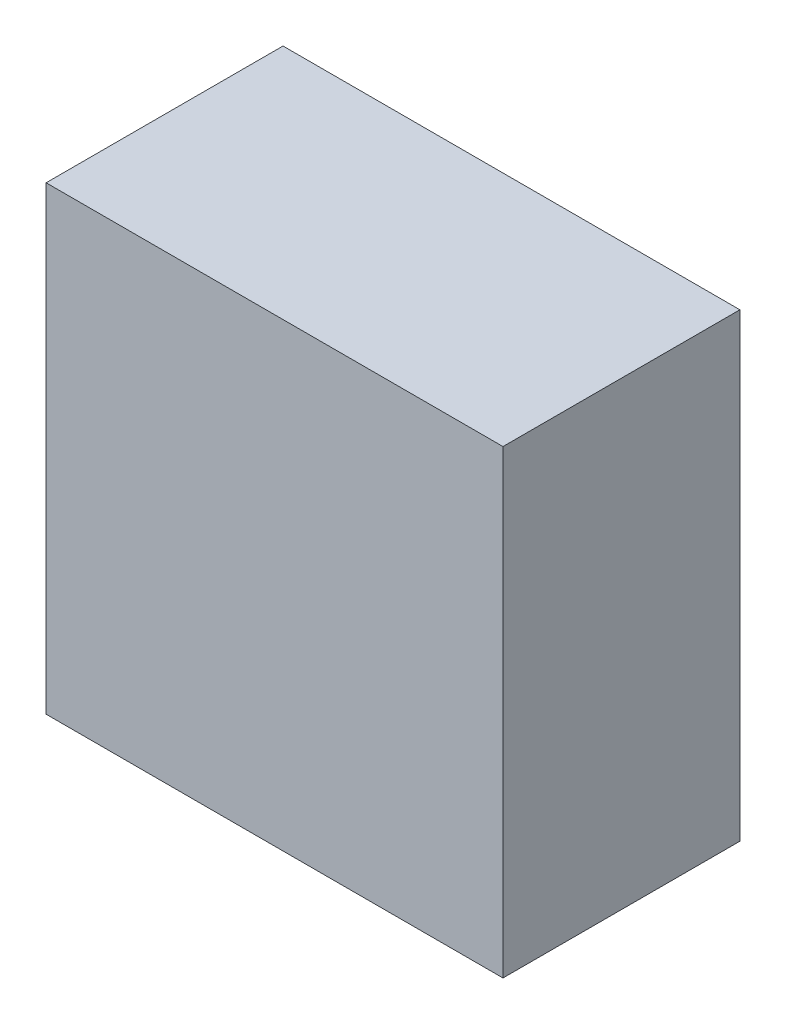
ISO-10303-21;
HEADER;
FILE_DESCRIPTION(('STEP AP214'),'2;1');
FILE_NAME('part.step','',(''),(''),'','','');
FILE_SCHEMA(('AUTOMOTIVE_DESIGN { 1 0 10303 214 1 1 1 1 }'));
ENDSEC;
DATA;
#1=APPLICATION_CONTEXT('core data for automotive mechanical design processes');
#2=APPLICATION_PROTOCOL_DEFINITION('international standard','automotive_design',2000,#1);
#3=PRODUCT_CONTEXT('',#1,'mechanical');
#4=PRODUCT('Part','Part','',(#3));
#5=PRODUCT_RELATED_PRODUCT_CATEGORY('part','',(#4));
#6=PRODUCT_DEFINITION_FORMATION('','',#4);
#7=PRODUCT_DEFINITION_CONTEXT('part definition',#1,'design');
#8=PRODUCT_DEFINITION('design','',#6,#7);
#9=PRODUCT_DEFINITION_SHAPE('','',#8);
#10=(LENGTH_UNIT() NAMED_UNIT(*) SI_UNIT(.MILLI.,.METRE.));
#11=(NAMED_UNIT(*) PLANE_ANGLE_UNIT() SI_UNIT($,.RADIAN.));
#12=(NAMED_UNIT(*) SI_UNIT($,.STERADIAN.) SOLID_ANGLE_UNIT());
#13=UNCERTAINTY_MEASURE_WITH_UNIT(LENGTH_MEASURE(1.E-05),#10,'distance_accuracy_value','');
#14=(GEOMETRIC_REPRESENTATION_CONTEXT(3) GLOBAL_UNCERTAINTY_ASSIGNED_CONTEXT((#13)) GLOBAL_UNIT_ASSIGNED_CONTEXT((#10,
#11,#12)) REPRESENTATION_CONTEXT('',''));
#15=CARTESIAN_POINT('',(0.,0.,0.));
#16=DIRECTION('',(0.,0.,1.));
#17=DIRECTION('',(1.,0.,0.));
#18=AXIS2_PLACEMENT_3D('',#15,#16,#17);
#19=CARTESIAN_POINT('',(0.67499992,-0.67999864,0.));
#20=DIRECTION('',(1.88148170224543E-06,-0.99999999999823,0.));
#21=DIRECTION('',(-0.99999999999823,-1.88148170224543E-06,0.));
#22=AXIS2_PLACEMENT_3D('',#19,#20,#21);
#23=PLANE('',#22);
#24=DIRECTION('',(0.,0.,1.));
#25=VECTOR('',#24,1.);
#26=CARTESIAN_POINT('',(0.67499992,-0.67999864,0.));
#27=LINE('',#26,#25);
#28=CARTESIAN_POINT('',(0.67499992,-0.67999864,0.));
#29=VERTEX_POINT('',#28);
#30=CARTESIAN_POINT('',(0.67499992,-0.67999864,0.70000114));
#31=VERTEX_POINT('',#30);
#32=EDGE_CURVE('E11',#29,#31,#27,.T.);
#33=ORIENTED_EDGE('',*,*,#32,.T.);
#34=DIRECTION('',(-0.99999999999823,-1.88148170224543E-06,0.));
#35=VECTOR('',#34,1.);
#36=CARTESIAN_POINT('',(0.67499992,-0.67999864,0.70000114));
#37=LINE('',#36,#35);
#38=CARTESIAN_POINT('',(-0.67499992,-0.68000118,0.70000114));
#39=VERTEX_POINT('',#38);
#40=EDGE_CURVE('E24',#31,#39,#37,.T.);
#41=ORIENTED_EDGE('',*,*,#40,.T.);
#42=DIRECTION('',(0.,0.,1.));
#43=VECTOR('',#42,1.);
#44=CARTESIAN_POINT('',(-0.67499992,-0.68000118,0.));
#45=LINE('',#44,#43);
#46=CARTESIAN_POINT('',(-0.67499992,-0.68000118,0.));
#47=VERTEX_POINT('',#46);
#48=EDGE_CURVE('E85',#47,#39,#45,.T.);
#49=ORIENTED_EDGE('',*,*,#48,.F.);
#50=DIRECTION('',(-0.99999999999823,-1.88148170224543E-06,0.));
#51=VECTOR('',#50,1.);
#52=CARTESIAN_POINT('',(0.67499992,-0.67999864,0.));
#53=LINE('',#52,#51);
#54=EDGE_CURVE('E83',#29,#47,#53,.T.);
#55=ORIENTED_EDGE('',*,*,#54,.F.);
#56=EDGE_LOOP('',(#33,#41,#49,#55));
#57=FACE_BOUND('',#56,.T.);
#58=ADVANCED_FACE('F17',(#57),#23,.T.);
#59=CARTESIAN_POINT('',(-0.67499992,-0.68000118,0.));
#60=DIRECTION('',(-1.,0.,0.));
#61=DIRECTION('',(0.,1.,0.));
#62=AXIS2_PLACEMENT_3D('',#59,#60,#61);
#63=PLANE('',#62);
#64=ORIENTED_EDGE('',*,*,#48,.T.);
#65=DIRECTION('',(0.,1.,0.));
#66=VECTOR('',#65,1.);
#67=CARTESIAN_POINT('',(-0.67499992,-0.68000118,0.70000114));
#68=LINE('',#67,#66);
#69=CARTESIAN_POINT('',(-0.67499992,0.68000118,0.70000114));
#70=VERTEX_POINT('',#69);
#71=EDGE_CURVE('E81',#39,#70,#68,.T.);
#72=ORIENTED_EDGE('',*,*,#71,.T.);
#73=DIRECTION('',(0.,0.,1.));
#74=VECTOR('',#73,1.);
#75=CARTESIAN_POINT('',(-0.67499992,0.68000118,0.));
#76=LINE('',#75,#74);
#77=CARTESIAN_POINT('',(-0.67499992,0.68000118,0.));
#78=VERTEX_POINT('',#77);
#79=EDGE_CURVE('E79',#78,#70,#76,.T.);
#80=ORIENTED_EDGE('',*,*,#79,.F.);
#81=DIRECTION('',(0.,1.,0.));
#82=VECTOR('',#81,1.);
#83=CARTESIAN_POINT('',(-0.67499992,-0.68000118,0.));
#84=LINE('',#83,#82);
#85=EDGE_CURVE('E70',#47,#78,#84,.T.);
#86=ORIENTED_EDGE('',*,*,#85,.F.);
#87=EDGE_LOOP('',(#64,#72,#80,#86));
#88=FACE_BOUND('',#87,.T.);
#89=ADVANCED_FACE('F90',(#88),#63,.T.);
#90=CARTESIAN_POINT('',(-0.67499992,0.68000118,0.));
#91=DIRECTION('',(-1.88148170224543E-06,0.99999999999823,0.));
#92=DIRECTION('',(0.99999999999823,1.88148170224543E-06,0.));
#93=AXIS2_PLACEMENT_3D('',#90,#91,#92);
#94=PLANE('',#93);
#95=ORIENTED_EDGE('',*,*,#79,.T.);
#96=DIRECTION('',(0.99999999999823,1.88148170224543E-06,0.));
#97=VECTOR('',#96,1.);
#98=CARTESIAN_POINT('',(-0.67499992,0.68000118,0.70000114));
#99=LINE('',#98,#97);
#100=CARTESIAN_POINT('',(0.67499992,0.68000372,0.70000114));
#101=VERTEX_POINT('',#100);
#102=EDGE_CURVE('E60',#70,#101,#99,.T.);
#103=ORIENTED_EDGE('',*,*,#102,.T.);
#104=DIRECTION('',(0.,0.,1.));
#105=VECTOR('',#104,1.);
#106=CARTESIAN_POINT('',(0.67499992,0.68000372,0.));
#107=LINE('',#106,#105);
#108=CARTESIAN_POINT('',(0.67499992,0.68000372,0.));
#109=VERTEX_POINT('',#108);
#110=EDGE_CURVE('E54',#109,#101,#107,.T.);
#111=ORIENTED_EDGE('',*,*,#110,.F.);
#112=DIRECTION('',(0.99999999999823,1.88148170224543E-06,0.));
#113=VECTOR('',#112,1.);
#114=CARTESIAN_POINT('',(-0.67499992,0.68000118,0.));
#115=LINE('',#114,#113);
#116=EDGE_CURVE('E58',#78,#109,#115,.T.);
#117=ORIENTED_EDGE('',*,*,#116,.F.);
#118=EDGE_LOOP('',(#95,#103,#111,#117));
#119=FACE_BOUND('',#118,.T.);
#120=ADVANCED_FACE('F57',(#119),#94,.T.);
#121=CARTESIAN_POINT('',(0.67499992,0.68000372,0.));
#122=DIRECTION('',(1.,0.,0.));
#123=DIRECTION('',(0.,-1.,0.));
#124=AXIS2_PLACEMENT_3D('',#121,#122,#123);
#125=PLANE('',#124);
#126=ORIENTED_EDGE('',*,*,#110,.T.);
#127=DIRECTION('',(0.,-1.,0.));
#128=VECTOR('',#127,1.);
#129=CARTESIAN_POINT('',(0.67499992,0.68000372,0.70000114));
#130=LINE('',#129,#128);
#131=EDGE_CURVE('E71',#101,#31,#130,.T.);
#132=ORIENTED_EDGE('',*,*,#131,.T.);
#133=ORIENTED_EDGE('',*,*,#32,.F.);
#134=DIRECTION('',(0.,-1.,0.));
#135=VECTOR('',#134,1.);
#136=CARTESIAN_POINT('',(0.67499992,0.68000372,0.));
#137=LINE('',#136,#135);
#138=EDGE_CURVE('E68',#109,#29,#137,.T.);
#139=ORIENTED_EDGE('',*,*,#138,.F.);
#140=EDGE_LOOP('',(#126,#132,#133,#139));
#141=FACE_BOUND('',#140,.T.);
#142=ADVANCED_FACE('F73',(#141),#125,.T.);
#143=CARTESIAN_POINT('',(0.67499992,-0.67999864,0.));
#144=DIRECTION('',(0.,0.,1.));
#145=DIRECTION('',(1.,0.,0.));
#146=AXIS2_PLACEMENT_3D('',#143,#144,#145);
#147=PLANE('',#146);
#148=ORIENTED_EDGE('',*,*,#54,.T.);
#149=ORIENTED_EDGE('',*,*,#85,.T.);
#150=ORIENTED_EDGE('',*,*,#116,.T.);
#151=ORIENTED_EDGE('',*,*,#138,.T.);
#152=EDGE_LOOP('',(#148,#149,#150,#151));
#153=FACE_BOUND('',#152,.T.);
#154=ADVANCED_FACE('F67',(#153),#147,.F.);
#155=CARTESIAN_POINT('',(0.67499992,-0.67999864,0.70000114));
#156=DIRECTION('',(0.,0.,1.));
#157=DIRECTION('',(1.,0.,0.));
#158=AXIS2_PLACEMENT_3D('',#155,#156,#157);
#159=PLANE('',#158);
#160=ORIENTED_EDGE('',*,*,#131,.F.);
#161=ORIENTED_EDGE('',*,*,#102,.F.);
#162=ORIENTED_EDGE('',*,*,#71,.F.);
#163=ORIENTED_EDGE('',*,*,#40,.F.);
#164=EDGE_LOOP('',(#160,#161,#162,#163));
#165=FACE_BOUND('',#164,.T.);
#166=ADVANCED_FACE('F91',(#165),#159,.T.);
#167=CLOSED_SHELL('',(#58,#89,#120,#142,#154,#166));
#168=MANIFOLD_SOLID_BREP('B1',#167);
#169=ADVANCED_BREP_SHAPE_REPRESENTATION('',(#18,#168),#14);
#170=SHAPE_DEFINITION_REPRESENTATION(#9,#169);
ENDSEC;
END-ISO-10303-21;
